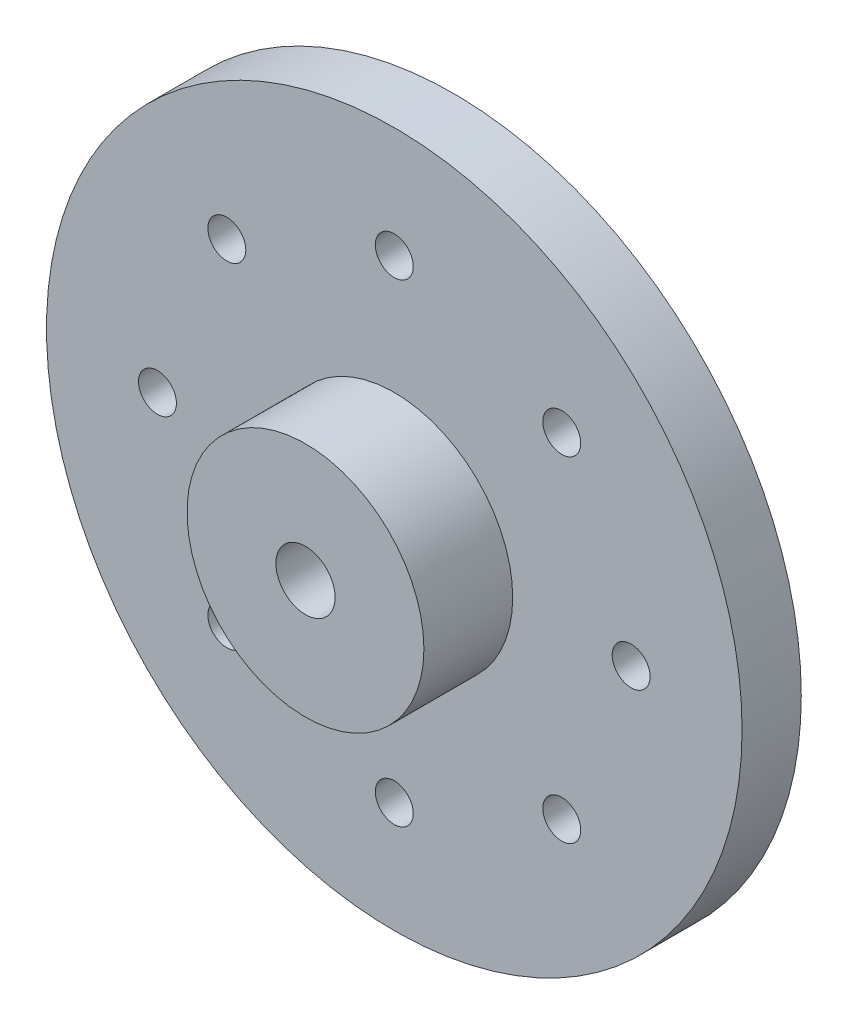
ISO-10303-21;
HEADER;
FILE_DESCRIPTION(('STEP AP214'),'2;1');
FILE_NAME('part.step','',(''),(''),'','','');
FILE_SCHEMA(('AUTOMOTIVE_DESIGN { 1 0 10303 214 1 1 1 1 }'));
ENDSEC;
DATA;
#1=APPLICATION_CONTEXT('core data for automotive mechanical design processes');
#2=APPLICATION_PROTOCOL_DEFINITION('international standard','automotive_design',2000,#1);
#3=PRODUCT_CONTEXT('',#1,'mechanical');
#4=PRODUCT('Part','Part','',(#3));
#5=PRODUCT_RELATED_PRODUCT_CATEGORY('part','',(#4));
#6=PRODUCT_DEFINITION_FORMATION('','',#4);
#7=PRODUCT_DEFINITION_CONTEXT('part definition',#1,'design');
#8=PRODUCT_DEFINITION('design','',#6,#7);
#9=PRODUCT_DEFINITION_SHAPE('','',#8);
#10=(LENGTH_UNIT() NAMED_UNIT(*) SI_UNIT(.MILLI.,.METRE.));
#11=(NAMED_UNIT(*) PLANE_ANGLE_UNIT() SI_UNIT($,.RADIAN.));
#12=(NAMED_UNIT(*) SI_UNIT($,.STERADIAN.) SOLID_ANGLE_UNIT());
#13=UNCERTAINTY_MEASURE_WITH_UNIT(LENGTH_MEASURE(1.E-05),#10,'distance_accuracy_value','');
#14=(GEOMETRIC_REPRESENTATION_CONTEXT(3) GLOBAL_UNCERTAINTY_ASSIGNED_CONTEXT((#13)) GLOBAL_UNIT_ASSIGNED_CONTEXT((#10,
#11,#12)) REPRESENTATION_CONTEXT('',''));
#15=CARTESIAN_POINT('',(0.,0.,0.));
#16=DIRECTION('',(0.,0.,1.));
#17=DIRECTION('',(1.,0.,0.));
#18=AXIS2_PLACEMENT_3D('',#15,#16,#17);
#19=CARTESIAN_POINT('',(0.,0.,0.));
#20=DIRECTION('',(0.,0.,1.));
#21=DIRECTION('',(1.,0.,0.));
#22=AXIS2_PLACEMENT_3D('',#19,#20,#21);
#23=PLANE('',#22);
#24=CARTESIAN_POINT('',(-5.65685424949228,5.65685424949214,0.));
#25=DIRECTION('',(0.,0.,1.));
#26=DIRECTION('',(1.,0.,0.));
#27=AXIS2_PLACEMENT_3D('',#24,#25,#26);
#28=CIRCLE('',#27,0.640765971643295);
#29=CARTESIAN_POINT('',(-5.01608827784899,5.65685424949214,0.));
#30=VERTEX_POINT('',#29);
#31=EDGE_CURVE('E96',#30,#30,#28,.T.);
#32=ORIENTED_EDGE('',*,*,#31,.T.);
#33=EDGE_LOOP('',(#32));
#34=FACE_BOUND('',#33,.T.);
#35=CARTESIAN_POINT('',(-7.99999999999966,-3.40601640478901E-13,0.));
#36=DIRECTION('',(0.,0.,1.));
#37=DIRECTION('',(1.,0.,0.));
#38=AXIS2_PLACEMENT_3D('',#35,#36,#37);
#39=CIRCLE('',#38,0.64076597164354);
#40=CARTESIAN_POINT('',(-7.35923402835612,-3.40601640478901E-13,0.));
#41=VERTEX_POINT('',#40);
#42=EDGE_CURVE('E90',#41,#41,#39,.T.);
#43=ORIENTED_EDGE('',*,*,#42,.T.);
#44=EDGE_LOOP('',(#43));
#45=FACE_BOUND('',#44,.T.);
#46=CARTESIAN_POINT('',(-5.6568542494918,-5.65685424949262,0.));
#47=DIRECTION('',(0.,0.,1.));
#48=DIRECTION('',(1.,0.,0.));
#49=AXIS2_PLACEMENT_3D('',#46,#47,#48);
#50=CIRCLE('',#49,0.640765971643727);
#51=CARTESIAN_POINT('',(-5.01608827784807,-5.65685424949262,0.));
#52=VERTEX_POINT('',#51);
#53=EDGE_CURVE('E84',#52,#52,#50,.T.);
#54=ORIENTED_EDGE('',*,*,#53,.T.);
#55=EDGE_LOOP('',(#54));
#56=FACE_BOUND('',#55,.T.);
#57=CARTESIAN_POINT('',(6.79702767299504E-13,-8.,0.));
#58=DIRECTION('',(0.,0.,1.));
#59=DIRECTION('',(1.,0.,0.));
#60=AXIS2_PLACEMENT_3D('',#57,#58,#59);
#61=CIRCLE('',#60,0.640765971643739);
#62=CARTESIAN_POINT('',(0.640765971644419,-8.,0.));
#63=VERTEX_POINT('',#62);
#64=EDGE_CURVE('E78',#63,#63,#61,.T.);
#65=ORIENTED_EDGE('',*,*,#64,.T.);
#66=EDGE_LOOP('',(#65));
#67=FACE_BOUND('',#66,.T.);
#68=CARTESIAN_POINT('',(5.65685424949296,-5.65685424949214,0.));
#69=DIRECTION('',(0.,0.,1.));
#70=DIRECTION('',(1.,0.,0.));
#71=AXIS2_PLACEMENT_3D('',#68,#69,#70);
#72=CIRCLE('',#71,0.64076597164356);
#73=CARTESIAN_POINT('',(6.29762022113652,-5.65685424949214,0.));
#74=VERTEX_POINT('',#73);
#75=EDGE_CURVE('E72',#74,#74,#72,.T.);
#76=ORIENTED_EDGE('',*,*,#75,.T.);
#77=EDGE_LOOP('',(#76));
#78=FACE_BOUND('',#77,.T.);
#79=CARTESIAN_POINT('',(8.00000000000034,3.39621923039584E-13,0.));
#80=DIRECTION('',(0.,0.,1.));
#81=DIRECTION('',(1.,0.,0.));
#82=AXIS2_PLACEMENT_3D('',#79,#80,#81);
#83=CIRCLE('',#82,0.640765971643287);
#84=CARTESIAN_POINT('',(8.64076597164363,3.39621923039584E-13,0.));
#85=VERTEX_POINT('',#84);
#86=EDGE_CURVE('E66',#85,#85,#83,.T.);
#87=ORIENTED_EDGE('',*,*,#86,.T.);
#88=EDGE_LOOP('',(#87));
#89=FACE_BOUND('',#88,.T.);
#90=CARTESIAN_POINT('',(5.65685424949248,5.65685424949262,0.));
#91=DIRECTION('',(0.,0.,1.));
#92=DIRECTION('',(1.,0.,0.));
#93=AXIS2_PLACEMENT_3D('',#90,#91,#92);
#94=CIRCLE('',#93,0.640765971643074);
#95=CARTESIAN_POINT('',(6.29762022113555,5.65685424949262,0.));
#96=VERTEX_POINT('',#95);
#97=EDGE_CURVE('E60',#96,#96,#94,.T.);
#98=ORIENTED_EDGE('',*,*,#97,.T.);
#99=EDGE_LOOP('',(#98));
#100=FACE_BOUND('',#99,.T.);
#101=CARTESIAN_POINT('',(0.,8.,0.));
#102=DIRECTION('',(0.,0.,1.));
#103=DIRECTION('',(1.,0.,0.));
#104=AXIS2_PLACEMENT_3D('',#101,#102,#103);
#105=CIRCLE('',#104,0.640765971643035);
#106=CARTESIAN_POINT('',(0.640765971643035,8.,0.));
#107=VERTEX_POINT('',#106);
#108=EDGE_CURVE('E54',#107,#107,#105,.T.);
#109=ORIENTED_EDGE('',*,*,#108,.T.);
#110=EDGE_LOOP('',(#109));
#111=FACE_BOUND('',#110,.T.);
#112=CARTESIAN_POINT('',(0.,0.,0.));
#113=DIRECTION('',(0.,0.,1.));
#114=DIRECTION('',(1.,0.,0.));
#115=AXIS2_PLACEMENT_3D('',#112,#113,#114);
#116=CIRCLE('',#115,11.747376146789);
#117=CARTESIAN_POINT('',(11.747376146789,0.,0.));
#118=VERTEX_POINT('',#117);
#119=EDGE_CURVE('E48',#118,#118,#116,.T.);
#120=ORIENTED_EDGE('',*,*,#119,.F.);
#121=EDGE_LOOP('',(#120));
#122=FACE_BOUND('',#121,.T.);
#123=CARTESIAN_POINT('',(0.,0.,0.));
#124=DIRECTION('',(0.,0.,1.));
#125=DIRECTION('',(1.,0.,0.));
#126=AXIS2_PLACEMENT_3D('',#123,#124,#125);
#127=CIRCLE('',#126,4.);
#128=CARTESIAN_POINT('',(4.,0.,0.));
#129=VERTEX_POINT('',#128);
#130=EDGE_CURVE('E41',#129,#129,#127,.F.);
#131=ORIENTED_EDGE('',*,*,#130,.F.);
#132=EDGE_LOOP('',(#131));
#133=FACE_BOUND('',#132,.T.);
#134=ADVANCED_FACE('F30',(#34,#45,#56,#67,#78,#89,#100,#111,#122,#133),#23,.F.);
#135=CARTESIAN_POINT('',(0.,0.,2.));
#136=DIRECTION('',(0.,0.,1.));
#137=DIRECTION('',(1.,0.,0.));
#138=AXIS2_PLACEMENT_3D('',#135,#136,#137);
#139=PLANE('',#138);
#140=CARTESIAN_POINT('',(-5.65685424949228,5.65685424949214,2.));
#141=DIRECTION('',(0.,0.,1.));
#142=DIRECTION('',(1.,0.,0.));
#143=AXIS2_PLACEMENT_3D('',#140,#141,#142);
#144=CIRCLE('',#143,0.640765971643295);
#145=CARTESIAN_POINT('',(-5.01608827784899,5.65685424949214,2.));
#146=VERTEX_POINT('',#145);
#147=EDGE_CURVE('E93',#146,#146,#144,.T.);
#148=ORIENTED_EDGE('',*,*,#147,.F.);
#149=EDGE_LOOP('',(#148));
#150=FACE_BOUND('',#149,.T.);
#151=CARTESIAN_POINT('',(-5.6568542494918,-5.65685424949262,2.));
#152=DIRECTION('',(0.,0.,1.));
#153=DIRECTION('',(1.,0.,0.));
#154=AXIS2_PLACEMENT_3D('',#151,#152,#153);
#155=CIRCLE('',#154,0.640765971643727);
#156=CARTESIAN_POINT('',(-5.01608827784807,-5.65685424949262,2.));
#157=VERTEX_POINT('',#156);
#158=EDGE_CURVE('E81',#157,#157,#155,.T.);
#159=ORIENTED_EDGE('',*,*,#158,.F.);
#160=EDGE_LOOP('',(#159));
#161=FACE_BOUND('',#160,.T.);
#162=CARTESIAN_POINT('',(5.65685424949296,-5.65685424949214,2.));
#163=DIRECTION('',(0.,0.,1.));
#164=DIRECTION('',(1.,0.,0.));
#165=AXIS2_PLACEMENT_3D('',#162,#163,#164);
#166=CIRCLE('',#165,0.64076597164356);
#167=CARTESIAN_POINT('',(6.29762022113652,-5.65685424949214,2.));
#168=VERTEX_POINT('',#167);
#169=EDGE_CURVE('E69',#168,#168,#166,.T.);
#170=ORIENTED_EDGE('',*,*,#169,.F.);
#171=EDGE_LOOP('',(#170));
#172=FACE_BOUND('',#171,.T.);
#173=CARTESIAN_POINT('',(5.65685424949248,5.65685424949262,2.));
#174=DIRECTION('',(0.,0.,1.));
#175=DIRECTION('',(1.,0.,0.));
#176=AXIS2_PLACEMENT_3D('',#173,#174,#175);
#177=CIRCLE('',#176,0.640765971643074);
#178=CARTESIAN_POINT('',(6.29762022113555,5.65685424949262,2.));
#179=VERTEX_POINT('',#178);
#180=EDGE_CURVE('E57',#179,#179,#177,.T.);
#181=ORIENTED_EDGE('',*,*,#180,.F.);
#182=EDGE_LOOP('',(#181));
#183=FACE_BOUND('',#182,.T.);
#184=CARTESIAN_POINT('',(0.,0.,2.));
#185=DIRECTION('',(0.,0.,1.));
#186=DIRECTION('',(1.,0.,0.));
#187=AXIS2_PLACEMENT_3D('',#184,#185,#186);
#188=CIRCLE('',#187,11.747376146789);
#189=CARTESIAN_POINT('',(11.747376146789,0.,2.));
#190=VERTEX_POINT('',#189);
#191=EDGE_CURVE('E45',#190,#190,#188,.T.);
#192=ORIENTED_EDGE('',*,*,#191,.T.);
#193=EDGE_LOOP('',(#192));
#194=FACE_BOUND('',#193,.T.);
#195=CARTESIAN_POINT('',(0.,8.,2.));
#196=DIRECTION('',(0.,0.,1.));
#197=DIRECTION('',(1.,0.,0.));
#198=AXIS2_PLACEMENT_3D('',#195,#196,#197);
#199=CIRCLE('',#198,0.640765971643035);
#200=CARTESIAN_POINT('',(0.640765971643035,8.,2.));
#201=VERTEX_POINT('',#200);
#202=EDGE_CURVE('E51',#201,#201,#199,.T.);
#203=ORIENTED_EDGE('',*,*,#202,.F.);
#204=EDGE_LOOP('',(#203));
#205=FACE_BOUND('',#204,.T.);
#206=CARTESIAN_POINT('',(8.00000000000034,3.39621923039584E-13,2.));
#207=DIRECTION('',(0.,0.,1.));
#208=DIRECTION('',(1.,0.,0.));
#209=AXIS2_PLACEMENT_3D('',#206,#207,#208);
#210=CIRCLE('',#209,0.640765971643287);
#211=CARTESIAN_POINT('',(8.64076597164363,3.39621923039584E-13,2.));
#212=VERTEX_POINT('',#211);
#213=EDGE_CURVE('E63',#212,#212,#210,.T.);
#214=ORIENTED_EDGE('',*,*,#213,.F.);
#215=EDGE_LOOP('',(#214));
#216=FACE_BOUND('',#215,.T.);
#217=CARTESIAN_POINT('',(6.79702767299504E-13,-8.,2.));
#218=DIRECTION('',(0.,0.,1.));
#219=DIRECTION('',(1.,0.,0.));
#220=AXIS2_PLACEMENT_3D('',#217,#218,#219);
#221=CIRCLE('',#220,0.640765971643739);
#222=CARTESIAN_POINT('',(0.640765971644419,-8.,2.));
#223=VERTEX_POINT('',#222);
#224=EDGE_CURVE('E75',#223,#223,#221,.T.);
#225=ORIENTED_EDGE('',*,*,#224,.F.);
#226=EDGE_LOOP('',(#225));
#227=FACE_BOUND('',#226,.T.);
#228=CARTESIAN_POINT('',(-7.99999999999966,-3.40601640478901E-13,2.));
#229=DIRECTION('',(0.,0.,1.));
#230=DIRECTION('',(1.,0.,0.));
#231=AXIS2_PLACEMENT_3D('',#228,#229,#230);
#232=CIRCLE('',#231,0.64076597164354);
#233=CARTESIAN_POINT('',(-7.35923402835612,-3.40601640478901E-13,2.));
#234=VERTEX_POINT('',#233);
#235=EDGE_CURVE('E87',#234,#234,#232,.T.);
#236=ORIENTED_EDGE('',*,*,#235,.F.);
#237=EDGE_LOOP('',(#236));
#238=FACE_BOUND('',#237,.T.);
#239=CARTESIAN_POINT('',(0.,0.,2.));
#240=DIRECTION('',(0.,0.,1.));
#241=DIRECTION('',(1.,0.,0.));
#242=AXIS2_PLACEMENT_3D('',#239,#240,#241);
#243=CIRCLE('',#242,4.);
#244=CARTESIAN_POINT('',(4.,0.,2.));
#245=VERTEX_POINT('',#244);
#246=EDGE_CURVE('E105',#245,#245,#243,.T.);
#247=ORIENTED_EDGE('',*,*,#246,.F.);
#248=EDGE_LOOP('',(#247));
#249=FACE_BOUND('',#248,.T.);
#250=ADVANCED_FACE('F136',(#150,#161,#172,#183,#194,#205,#216,#227,#238,#249),#139,.T.);
#251=CARTESIAN_POINT('',(0.,0.,2.));
#252=DIRECTION('',(0.,0.,-1.));
#253=DIRECTION('',(-1.,0.,0.));
#254=AXIS2_PLACEMENT_3D('',#251,#252,#253);
#255=CYLINDRICAL_SURFACE('',#254,11.747376146789);
#256=ORIENTED_EDGE('',*,*,#191,.F.);
#257=EDGE_LOOP('',(#256));
#258=FACE_BOUND('',#257,.T.);
#259=ORIENTED_EDGE('',*,*,#119,.T.);
#260=EDGE_LOOP('',(#259));
#261=FACE_BOUND('',#260,.T.);
#262=ADVANCED_FACE('F142',(#258,#261),#255,.T.);
#263=CARTESIAN_POINT('',(0.,0.,2.));
#264=DIRECTION('',(0.,0.,-1.));
#265=DIRECTION('',(-1.,0.,0.));
#266=AXIS2_PLACEMENT_3D('',#263,#264,#265);
#267=CYLINDRICAL_SURFACE('',#266,2.66985821517932);
#268=CARTESIAN_POINT('',(0.,0.,2.));
#269=DIRECTION('',(0.,0.,1.));
#270=DIRECTION('',(1.,0.,0.));
#271=AXIS2_PLACEMENT_3D('',#268,#269,#270);
#272=CIRCLE('',#271,2.66985821517932);
#273=CARTESIAN_POINT('',(2.66985821517932,0.,2.));
#274=VERTEX_POINT('',#273);
#275=EDGE_CURVE('E99',#274,#274,#272,.T.);
#276=ORIENTED_EDGE('',*,*,#275,.T.);
#277=EDGE_LOOP('',(#276));
#278=FACE_BOUND('',#277,.T.);
#279=CARTESIAN_POINT('',(0.,0.,-1.));
#280=DIRECTION('',(0.,0.,-1.));
#281=DIRECTION('',(-1.,0.,0.));
#282=AXIS2_PLACEMENT_3D('',#279,#280,#281);
#283=CIRCLE('',#282,2.66985821517932);
#284=CARTESIAN_POINT('',(-2.66985821517932,0.,-1.));
#285=VERTEX_POINT('',#284);
#286=EDGE_CURVE('E114',#285,#285,#283,.T.);
#287=ORIENTED_EDGE('',*,*,#286,.T.);
#288=EDGE_LOOP('',(#287));
#289=FACE_BOUND('',#288,.T.);
#290=ADVANCED_FACE('F120',(#278,#289),#267,.F.);
#291=CARTESIAN_POINT('',(0.,8.,2.));
#292=DIRECTION('',(0.,0.,-1.));
#293=DIRECTION('',(-1.,0.,0.));
#294=AXIS2_PLACEMENT_3D('',#291,#292,#293);
#295=CYLINDRICAL_SURFACE('',#294,0.640765971643035);
#296=ORIENTED_EDGE('',*,*,#202,.T.);
#297=EDGE_LOOP('',(#296));
#298=FACE_BOUND('',#297,.T.);
#299=ORIENTED_EDGE('',*,*,#108,.F.);
#300=EDGE_LOOP('',(#299));
#301=FACE_BOUND('',#300,.T.);
#302=ADVANCED_FACE('F152',(#298,#301),#295,.F.);
#303=CARTESIAN_POINT('',(5.65685424949248,5.65685424949262,2.));
#304=DIRECTION('',(0.,0.,-1.));
#305=DIRECTION('',(-1.,0.,0.));
#306=AXIS2_PLACEMENT_3D('',#303,#304,#305);
#307=CYLINDRICAL_SURFACE('',#306,0.640765971643074);
#308=ORIENTED_EDGE('',*,*,#180,.T.);
#309=EDGE_LOOP('',(#308));
#310=FACE_BOUND('',#309,.T.);
#311=ORIENTED_EDGE('',*,*,#97,.F.);
#312=EDGE_LOOP('',(#311));
#313=FACE_BOUND('',#312,.T.);
#314=ADVANCED_FACE('F209',(#310,#313),#307,.F.);
#315=CARTESIAN_POINT('',(8.00000000000034,3.39621923039584E-13,2.));
#316=DIRECTION('',(0.,0.,-1.));
#317=DIRECTION('',(-1.,0.,0.));
#318=AXIS2_PLACEMENT_3D('',#315,#316,#317);
#319=CYLINDRICAL_SURFACE('',#318,0.640765971643287);
#320=ORIENTED_EDGE('',*,*,#213,.T.);
#321=EDGE_LOOP('',(#320));
#322=FACE_BOUND('',#321,.T.);
#323=ORIENTED_EDGE('',*,*,#86,.F.);
#324=EDGE_LOOP('',(#323));
#325=FACE_BOUND('',#324,.T.);
#326=ADVANCED_FACE('F205',(#322,#325),#319,.F.);
#327=CARTESIAN_POINT('',(5.65685424949296,-5.65685424949214,2.));
#328=DIRECTION('',(0.,0.,-1.));
#329=DIRECTION('',(-1.,0.,0.));
#330=AXIS2_PLACEMENT_3D('',#327,#328,#329);
#331=CYLINDRICAL_SURFACE('',#330,0.64076597164356);
#332=ORIENTED_EDGE('',*,*,#169,.T.);
#333=EDGE_LOOP('',(#332));
#334=FACE_BOUND('',#333,.T.);
#335=ORIENTED_EDGE('',*,*,#75,.F.);
#336=EDGE_LOOP('',(#335));
#337=FACE_BOUND('',#336,.T.);
#338=ADVANCED_FACE('F201',(#334,#337),#331,.F.);
#339=CARTESIAN_POINT('',(6.79702767299504E-13,-8.,2.));
#340=DIRECTION('',(0.,0.,-1.));
#341=DIRECTION('',(-1.,0.,0.));
#342=AXIS2_PLACEMENT_3D('',#339,#340,#341);
#343=CYLINDRICAL_SURFACE('',#342,0.640765971643739);
#344=ORIENTED_EDGE('',*,*,#224,.T.);
#345=EDGE_LOOP('',(#344));
#346=FACE_BOUND('',#345,.T.);
#347=ORIENTED_EDGE('',*,*,#64,.F.);
#348=EDGE_LOOP('',(#347));
#349=FACE_BOUND('',#348,.T.);
#350=ADVANCED_FACE('F197',(#346,#349),#343,.F.);
#351=CARTESIAN_POINT('',(-5.6568542494918,-5.65685424949262,2.));
#352=DIRECTION('',(0.,0.,-1.));
#353=DIRECTION('',(-1.,0.,0.));
#354=AXIS2_PLACEMENT_3D('',#351,#352,#353);
#355=CYLINDRICAL_SURFACE('',#354,0.640765971643727);
#356=ORIENTED_EDGE('',*,*,#158,.T.);
#357=EDGE_LOOP('',(#356));
#358=FACE_BOUND('',#357,.T.);
#359=ORIENTED_EDGE('',*,*,#53,.F.);
#360=EDGE_LOOP('',(#359));
#361=FACE_BOUND('',#360,.T.);
#362=ADVANCED_FACE('F193',(#358,#361),#355,.F.);
#363=CARTESIAN_POINT('',(-7.99999999999966,-3.40601640478901E-13,2.));
#364=DIRECTION('',(0.,0.,-1.));
#365=DIRECTION('',(-1.,0.,0.));
#366=AXIS2_PLACEMENT_3D('',#363,#364,#365);
#367=CYLINDRICAL_SURFACE('',#366,0.64076597164354);
#368=ORIENTED_EDGE('',*,*,#235,.T.);
#369=EDGE_LOOP('',(#368));
#370=FACE_BOUND('',#369,.T.);
#371=ORIENTED_EDGE('',*,*,#42,.F.);
#372=EDGE_LOOP('',(#371));
#373=FACE_BOUND('',#372,.T.);
#374=ADVANCED_FACE('F189',(#370,#373),#367,.F.);
#375=CARTESIAN_POINT('',(-5.65685424949228,5.65685424949214,2.));
#376=DIRECTION('',(0.,0.,-1.));
#377=DIRECTION('',(-1.,0.,0.));
#378=AXIS2_PLACEMENT_3D('',#375,#376,#377);
#379=CYLINDRICAL_SURFACE('',#378,0.640765971643295);
#380=ORIENTED_EDGE('',*,*,#147,.T.);
#381=EDGE_LOOP('',(#380));
#382=FACE_BOUND('',#381,.T.);
#383=ORIENTED_EDGE('',*,*,#31,.F.);
#384=EDGE_LOOP('',(#383));
#385=FACE_BOUND('',#384,.T.);
#386=ADVANCED_FACE('F186',(#382,#385),#379,.F.);
#387=CARTESIAN_POINT('',(0.,0.,5.));
#388=DIRECTION('',(0.,0.,1.));
#389=DIRECTION('',(1.,0.,0.));
#390=AXIS2_PLACEMENT_3D('',#387,#388,#389);
#391=PLANE('',#390);
#392=CARTESIAN_POINT('',(0.,0.,5.));
#393=DIRECTION('',(0.,0.,1.));
#394=DIRECTION('',(1.,0.,0.));
#395=AXIS2_PLACEMENT_3D('',#392,#393,#394);
#396=CIRCLE('',#395,4.);
#397=CARTESIAN_POINT('',(4.,0.,5.));
#398=VERTEX_POINT('',#397);
#399=EDGE_CURVE('E104',#398,#398,#396,.T.);
#400=ORIENTED_EDGE('',*,*,#399,.T.);
#401=EDGE_LOOP('',(#400));
#402=FACE_BOUND('',#401,.T.);
#403=CARTESIAN_POINT('',(0.,0.,5.));
#404=DIRECTION('',(0.,0.,1.));
#405=DIRECTION('',(1.,0.,0.));
#406=AXIS2_PLACEMENT_3D('',#403,#404,#405);
#407=CIRCLE('',#406,1.);
#408=CARTESIAN_POINT('',(1.,0.,5.));
#409=VERTEX_POINT('',#408);
#410=EDGE_CURVE('E108',#409,#409,#407,.T.);
#411=ORIENTED_EDGE('',*,*,#410,.F.);
#412=EDGE_LOOP('',(#411));
#413=FACE_BOUND('',#412,.T.);
#414=ADVANCED_FACE('F180',(#402,#413),#391,.T.);
#415=CARTESIAN_POINT('',(0.,0.,2.));
#416=DIRECTION('',(0.,0.,1.));
#417=DIRECTION('',(1.,0.,0.));
#418=AXIS2_PLACEMENT_3D('',#415,#416,#417);
#419=PLANE('',#418);
#420=ORIENTED_EDGE('',*,*,#275,.F.);
#421=EDGE_LOOP('',(#420));
#422=FACE_BOUND('',#421,.T.);
#423=CARTESIAN_POINT('',(0.,0.,2.));
#424=DIRECTION('',(0.,0.,1.));
#425=DIRECTION('',(1.,0.,0.));
#426=AXIS2_PLACEMENT_3D('',#423,#424,#425);
#427=CIRCLE('',#426,1.);
#428=CARTESIAN_POINT('',(1.,0.,2.));
#429=VERTEX_POINT('',#428);
#430=EDGE_CURVE('E111',#429,#429,#427,.T.);
#431=ORIENTED_EDGE('',*,*,#430,.T.);
#432=EDGE_LOOP('',(#431));
#433=FACE_BOUND('',#432,.T.);
#434=ADVANCED_FACE('F174',(#422,#433),#419,.F.);
#435=CARTESIAN_POINT('',(0.,0.,5.));
#436=DIRECTION('',(0.,0.,-1.));
#437=DIRECTION('',(-1.,0.,0.));
#438=AXIS2_PLACEMENT_3D('',#435,#436,#437);
#439=CYLINDRICAL_SURFACE('',#438,4.);
#440=ORIENTED_EDGE('',*,*,#399,.F.);
#441=EDGE_LOOP('',(#440));
#442=FACE_BOUND('',#441,.T.);
#443=ORIENTED_EDGE('',*,*,#246,.T.);
#444=EDGE_LOOP('',(#443));
#445=FACE_BOUND('',#444,.T.);
#446=ADVANCED_FACE('F132',(#442,#445),#439,.T.);
#447=CARTESIAN_POINT('',(0.,0.,5.));
#448=DIRECTION('',(0.,0.,-1.));
#449=DIRECTION('',(-1.,0.,0.));
#450=AXIS2_PLACEMENT_3D('',#447,#448,#449);
#451=CYLINDRICAL_SURFACE('',#450,1.);
#452=ORIENTED_EDGE('',*,*,#410,.T.);
#453=EDGE_LOOP('',(#452));
#454=FACE_BOUND('',#453,.T.);
#455=ORIENTED_EDGE('',*,*,#430,.F.);
#456=EDGE_LOOP('',(#455));
#457=FACE_BOUND('',#456,.T.);
#458=ADVANCED_FACE('F125',(#454,#457),#451,.F.);
#459=CARTESIAN_POINT('',(0.,0.,-1.));
#460=DIRECTION('',(0.,0.,-1.));
#461=DIRECTION('',(-1.,0.,0.));
#462=AXIS2_PLACEMENT_3D('',#459,#460,#461);
#463=PLANE('',#462);
#464=CARTESIAN_POINT('',(0.,0.,-1.));
#465=DIRECTION('',(0.,0.,-1.));
#466=DIRECTION('',(-1.,0.,0.));
#467=AXIS2_PLACEMENT_3D('',#464,#465,#466);
#468=CIRCLE('',#467,3.4);
#469=CARTESIAN_POINT('',(-3.4,0.,-1.));
#470=VERTEX_POINT('',#469);
#471=EDGE_CURVE('E37',#470,#470,#468,.T.);
#472=ORIENTED_EDGE('',*,*,#471,.T.);
#473=EDGE_LOOP('',(#472));
#474=FACE_BOUND('',#473,.T.);
#475=ORIENTED_EDGE('',*,*,#286,.F.);
#476=EDGE_LOOP('',(#475));
#477=FACE_BOUND('',#476,.T.);
#478=ADVANCED_FACE('F122',(#474,#477),#463,.T.);
#479=CARTESIAN_POINT('',(0.,0.,-1.));
#480=DIRECTION('',(0.,0.,1.));
#481=DIRECTION('',(1.,0.,0.));
#482=AXIS2_PLACEMENT_3D('',#479,#480,#481);
#483=CYLINDRICAL_SURFACE('',#482,4.);
#484=CARTESIAN_POINT('',(0.,0.,-0.400000000000002));
#485=DIRECTION('',(0.,0.,-1.));
#486=DIRECTION('',(-1.,0.,0.));
#487=AXIS2_PLACEMENT_3D('',#484,#485,#486);
#488=CIRCLE('',#487,4.);
#489=CARTESIAN_POINT('',(-4.,0.,-0.400000000000002));
#490=VERTEX_POINT('',#489);
#491=EDGE_CURVE('E10',#490,#490,#488,.F.);
#492=ORIENTED_EDGE('',*,*,#491,.T.);
#493=EDGE_LOOP('',(#492));
#494=FACE_BOUND('',#493,.T.);
#495=ORIENTED_EDGE('',*,*,#130,.T.);
#496=EDGE_LOOP('',(#495));
#497=FACE_BOUND('',#496,.T.);
#498=ADVANCED_FACE('F124',(#494,#497),#483,.T.);
#499=CARTESIAN_POINT('',(0.,0.,-1.));
#500=DIRECTION('',(0.,0.,1.));
#501=DIRECTION('',(1.,0.,0.));
#502=AXIS2_PLACEMENT_3D('',#499,#500,#501);
#503=CONICAL_SURFACE('',#502,3.4,0.78539816339745);
#504=ORIENTED_EDGE('',*,*,#491,.F.);
#505=EDGE_LOOP('',(#504));
#506=FACE_BOUND('',#505,.T.);
#507=ORIENTED_EDGE('',*,*,#471,.F.);
#508=EDGE_LOOP('',(#507));
#509=FACE_BOUND('',#508,.T.);
#510=ADVANCED_FACE('F32',(#506,#509),#503,.T.);
#511=CLOSED_SHELL('',(#134,#250,#262,#290,#302,#314,#326,#338,#350,#362,#374,#386,#414,#434,
#446,#458,#478,#498,#510));
#512=MANIFOLD_SOLID_BREP('B2',#511);
#513=ADVANCED_BREP_SHAPE_REPRESENTATION('',(#18,#512),#14);
#514=SHAPE_DEFINITION_REPRESENTATION(#9,#513);
ENDSEC;
END-ISO-10303-21;
